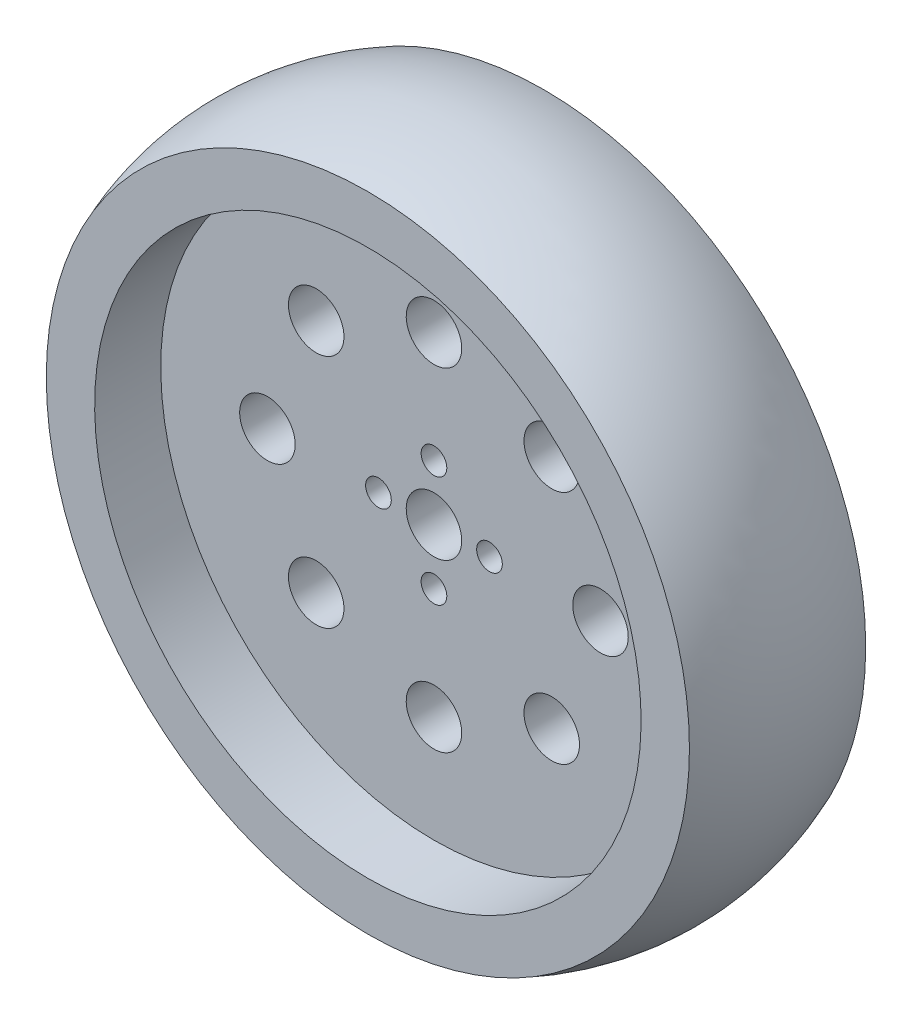
ISO-10303-21;
HEADER;
FILE_DESCRIPTION(('STEP AP214'),'2;1');
FILE_NAME('part.step','',(''),(''),'','','');
FILE_SCHEMA(('AUTOMOTIVE_DESIGN { 1 0 10303 214 1 1 1 1 }'));
ENDSEC;
DATA;
#1=APPLICATION_CONTEXT('core data for automotive mechanical design processes');
#2=APPLICATION_PROTOCOL_DEFINITION('international standard','automotive_design',2000,#1);
#3=PRODUCT_CONTEXT('',#1,'mechanical');
#4=PRODUCT('Part','Part','',(#3));
#5=PRODUCT_RELATED_PRODUCT_CATEGORY('part','',(#4));
#6=PRODUCT_DEFINITION_FORMATION('','',#4);
#7=PRODUCT_DEFINITION_CONTEXT('part definition',#1,'design');
#8=PRODUCT_DEFINITION('design','',#6,#7);
#9=PRODUCT_DEFINITION_SHAPE('','',#8);
#10=(LENGTH_UNIT() NAMED_UNIT(*) SI_UNIT(.MILLI.,.METRE.));
#11=(NAMED_UNIT(*) PLANE_ANGLE_UNIT() SI_UNIT($,.RADIAN.));
#12=(NAMED_UNIT(*) SI_UNIT($,.STERADIAN.) SOLID_ANGLE_UNIT());
#13=UNCERTAINTY_MEASURE_WITH_UNIT(LENGTH_MEASURE(1.E-05),#10,'distance_accuracy_value','');
#14=(GEOMETRIC_REPRESENTATION_CONTEXT(3) GLOBAL_UNCERTAINTY_ASSIGNED_CONTEXT((#13)) GLOBAL_UNIT_ASSIGNED_CONTEXT((#10,
#11,#12)) REPRESENTATION_CONTEXT('',''));
#15=CARTESIAN_POINT('',(0.,0.,0.));
#16=DIRECTION('',(0.,0.,1.));
#17=DIRECTION('',(1.,0.,0.));
#18=AXIS2_PLACEMENT_3D('',#15,#16,#17);
#19=CARTESIAN_POINT('',(0.,0.,-3.17500000000001));
#20=DIRECTION('',(0.,0.,1.));
#21=DIRECTION('',(0.,-1.,0.));
#22=AXIS2_PLACEMENT_3D('',#19,#20,#21);
#23=CYLINDRICAL_SURFACE('',#22,4.);
#24=CARTESIAN_POINT('',(0.,0.,3.175));
#25=DIRECTION('',(0.,0.,1.));
#26=DIRECTION('',(0.,-1.,0.));
#27=AXIS2_PLACEMENT_3D('',#24,#25,#26);
#28=CIRCLE('',#27,4.);
#29=CARTESIAN_POINT('',(0.,-4.,3.175));
#30=VERTEX_POINT('',#29);
#31=EDGE_CURVE('E19',#30,#30,#28,.F.);
#32=ORIENTED_EDGE('',*,*,#31,.F.);
#33=EDGE_LOOP('',(#32));
#34=FACE_BOUND('',#33,.T.);
#35=CARTESIAN_POINT('',(0.,0.,-3.17500000000001));
#36=DIRECTION('',(0.,0.,1.));
#37=DIRECTION('',(0.,-1.,0.));
#38=AXIS2_PLACEMENT_3D('',#35,#36,#37);
#39=CIRCLE('',#38,4.);
#40=CARTESIAN_POINT('',(0.,-4.,-3.17500000000001));
#41=VERTEX_POINT('',#40);
#42=EDGE_CURVE('E78',#41,#41,#39,.F.);
#43=ORIENTED_EDGE('',*,*,#42,.T.);
#44=EDGE_LOOP('',(#43));
#45=FACE_BOUND('',#44,.T.);
#46=ADVANCED_FACE('F15',(#34,#45),#23,.F.);
#47=CARTESIAN_POINT('',(8.,0.,-15.24));
#48=DIRECTION('',(0.,0.,1.));
#49=DIRECTION('',(1.,0.,0.));
#50=AXIS2_PLACEMENT_3D('',#47,#48,#49);
#51=CYLINDRICAL_SURFACE('',#50,1.85);
#52=CARTESIAN_POINT('',(8.,0.,3.175));
#53=DIRECTION('',(0.,0.,1.));
#54=DIRECTION('',(1.,0.,0.));
#55=AXIS2_PLACEMENT_3D('',#52,#53,#54);
#56=CIRCLE('',#55,1.85);
#57=CARTESIAN_POINT('',(9.85,0.,3.175));
#58=VERTEX_POINT('',#57);
#59=EDGE_CURVE('E113',#58,#58,#56,.F.);
#60=ORIENTED_EDGE('',*,*,#59,.F.);
#61=EDGE_LOOP('',(#60));
#62=FACE_BOUND('',#61,.T.);
#63=CARTESIAN_POINT('',(8.,0.,-3.17500000000001));
#64=DIRECTION('',(0.,0.,1.));
#65=DIRECTION('',(1.,0.,0.));
#66=AXIS2_PLACEMENT_3D('',#63,#64,#65);
#67=CIRCLE('',#66,1.85);
#68=CARTESIAN_POINT('',(9.85,0.,-3.17500000000001));
#69=VERTEX_POINT('',#68);
#70=EDGE_CURVE('E75',#69,#69,#67,.F.);
#71=ORIENTED_EDGE('',*,*,#70,.T.);
#72=EDGE_LOOP('',(#71));
#73=FACE_BOUND('',#72,.T.);
#74=ADVANCED_FACE('F125',(#62,#73),#51,.F.);
#75=CARTESIAN_POINT('',(0.,-8.,-15.24));
#76=DIRECTION('',(0.,0.,1.));
#77=DIRECTION('',(1.,0.,0.));
#78=AXIS2_PLACEMENT_3D('',#75,#76,#77);
#79=CYLINDRICAL_SURFACE('',#78,1.85);
#80=CARTESIAN_POINT('',(0.,-8.,3.175));
#81=DIRECTION('',(0.,0.,1.));
#82=DIRECTION('',(1.,0.,0.));
#83=AXIS2_PLACEMENT_3D('',#80,#81,#82);
#84=CIRCLE('',#83,1.85);
#85=CARTESIAN_POINT('',(1.85,-8.,3.175));
#86=VERTEX_POINT('',#85);
#87=EDGE_CURVE('E111',#86,#86,#84,.F.);
#88=ORIENTED_EDGE('',*,*,#87,.F.);
#89=EDGE_LOOP('',(#88));
#90=FACE_BOUND('',#89,.T.);
#91=CARTESIAN_POINT('',(0.,-8.,-3.175));
#92=DIRECTION('',(0.,0.,1.));
#93=DIRECTION('',(1.,0.,0.));
#94=AXIS2_PLACEMENT_3D('',#91,#92,#93);
#95=CIRCLE('',#94,1.85);
#96=CARTESIAN_POINT('',(1.85,-8.,-3.175));
#97=VERTEX_POINT('',#96);
#98=EDGE_CURVE('E72',#97,#97,#95,.F.);
#99=ORIENTED_EDGE('',*,*,#98,.T.);
#100=EDGE_LOOP('',(#99));
#101=FACE_BOUND('',#100,.T.);
#102=ADVANCED_FACE('F298',(#90,#101),#79,.F.);
#103=CARTESIAN_POINT('',(-8.,0.,-15.24));
#104=DIRECTION('',(0.,0.,1.));
#105=DIRECTION('',(1.,0.,0.));
#106=AXIS2_PLACEMENT_3D('',#103,#104,#105);
#107=CYLINDRICAL_SURFACE('',#106,1.85);
#108=CARTESIAN_POINT('',(-8.,0.,3.175));
#109=DIRECTION('',(0.,0.,1.));
#110=DIRECTION('',(1.,0.,0.));
#111=AXIS2_PLACEMENT_3D('',#108,#109,#110);
#112=CIRCLE('',#111,1.85);
#113=CARTESIAN_POINT('',(-6.15,0.,3.175));
#114=VERTEX_POINT('',#113);
#115=EDGE_CURVE('E108',#114,#114,#112,.F.);
#116=ORIENTED_EDGE('',*,*,#115,.F.);
#117=EDGE_LOOP('',(#116));
#118=FACE_BOUND('',#117,.T.);
#119=CARTESIAN_POINT('',(-8.,0.,-3.17500000000001));
#120=DIRECTION('',(0.,0.,1.));
#121=DIRECTION('',(1.,0.,0.));
#122=AXIS2_PLACEMENT_3D('',#119,#120,#121);
#123=CIRCLE('',#122,1.85);
#124=CARTESIAN_POINT('',(-6.15,0.,-3.17500000000001));
#125=VERTEX_POINT('',#124);
#126=EDGE_CURVE('E69',#125,#125,#123,.F.);
#127=ORIENTED_EDGE('',*,*,#126,.T.);
#128=EDGE_LOOP('',(#127));
#129=FACE_BOUND('',#128,.T.);
#130=ADVANCED_FACE('F288',(#118,#129),#107,.F.);
#131=CARTESIAN_POINT('',(0.,8.,-15.24));
#132=DIRECTION('',(0.,0.,1.));
#133=DIRECTION('',(1.,0.,0.));
#134=AXIS2_PLACEMENT_3D('',#131,#132,#133);
#135=CYLINDRICAL_SURFACE('',#134,1.85);
#136=CARTESIAN_POINT('',(0.,8.,3.175));
#137=DIRECTION('',(0.,0.,1.));
#138=DIRECTION('',(1.,0.,0.));
#139=AXIS2_PLACEMENT_3D('',#136,#137,#138);
#140=CIRCLE('',#139,1.85);
#141=CARTESIAN_POINT('',(1.85,8.,3.175));
#142=VERTEX_POINT('',#141);
#143=EDGE_CURVE('E105',#142,#142,#140,.F.);
#144=ORIENTED_EDGE('',*,*,#143,.F.);
#145=EDGE_LOOP('',(#144));
#146=FACE_BOUND('',#145,.T.);
#147=CARTESIAN_POINT('',(0.,8.,-3.17500000000001));
#148=DIRECTION('',(0.,0.,1.));
#149=DIRECTION('',(1.,0.,0.));
#150=AXIS2_PLACEMENT_3D('',#147,#148,#149);
#151=CIRCLE('',#150,1.85);
#152=CARTESIAN_POINT('',(1.85,8.,-3.17500000000001));
#153=VERTEX_POINT('',#152);
#154=EDGE_CURVE('E66',#153,#153,#151,.F.);
#155=ORIENTED_EDGE('',*,*,#154,.T.);
#156=EDGE_LOOP('',(#155));
#157=FACE_BOUND('',#156,.T.);
#158=ADVANCED_FACE('F278',(#146,#157),#135,.F.);
#159=CARTESIAN_POINT('',(0.,-24.,3.17500000000001));
#160=DIRECTION('',(0.,0.,-1.));
#161=DIRECTION('',(0.,1.,0.));
#162=AXIS2_PLACEMENT_3D('',#159,#160,#161);
#163=CYLINDRICAL_SURFACE('',#162,4.);
#164=CARTESIAN_POINT('',(0.,-24.,3.175));
#165=DIRECTION('',(0.,0.,-1.));
#166=DIRECTION('',(0.,1.,0.));
#167=AXIS2_PLACEMENT_3D('',#164,#165,#166);
#168=CIRCLE('',#167,4.);
#169=CARTESIAN_POINT('',(0.,-20.,3.175));
#170=VERTEX_POINT('',#169);
#171=EDGE_CURVE('E102',#170,#170,#168,.T.);
#172=ORIENTED_EDGE('',*,*,#171,.F.);
#173=EDGE_LOOP('',(#172));
#174=FACE_BOUND('',#173,.T.);
#175=CARTESIAN_POINT('',(0.,-24.,-3.175));
#176=DIRECTION('',(0.,0.,-1.));
#177=DIRECTION('',(0.,1.,0.));
#178=AXIS2_PLACEMENT_3D('',#175,#176,#177);
#179=CIRCLE('',#178,4.);
#180=CARTESIAN_POINT('',(0.,-20.,-3.175));
#181=VERTEX_POINT('',#180);
#182=EDGE_CURVE('E63',#181,#181,#179,.T.);
#183=ORIENTED_EDGE('',*,*,#182,.T.);
#184=EDGE_LOOP('',(#183));
#185=FACE_BOUND('',#184,.T.);
#186=ADVANCED_FACE('F268',(#174,#185),#163,.F.);
#187=CARTESIAN_POINT('',(16.9705627484771,-16.9705627484771,3.175));
#188=DIRECTION('',(0.,0.,-1.));
#189=DIRECTION('',(0.,1.,0.));
#190=AXIS2_PLACEMENT_3D('',#187,#188,#189);
#191=CYLINDRICAL_SURFACE('',#190,4.);
#192=CARTESIAN_POINT('',(16.9705627484771,-16.9705627484771,3.175));
#193=DIRECTION('',(0.,0.,-1.));
#194=DIRECTION('',(0.,1.,0.));
#195=AXIS2_PLACEMENT_3D('',#192,#193,#194);
#196=CIRCLE('',#195,4.);
#197=CARTESIAN_POINT('',(16.9705627484771,-12.9705627484771,3.175));
#198=VERTEX_POINT('',#197);
#199=EDGE_CURVE('E99',#198,#198,#196,.T.);
#200=ORIENTED_EDGE('',*,*,#199,.F.);
#201=EDGE_LOOP('',(#200));
#202=FACE_BOUND('',#201,.T.);
#203=CARTESIAN_POINT('',(16.9705627484771,-16.9705627484771,-3.175));
#204=DIRECTION('',(0.,0.,-1.));
#205=DIRECTION('',(0.,1.,0.));
#206=AXIS2_PLACEMENT_3D('',#203,#204,#205);
#207=CIRCLE('',#206,4.);
#208=CARTESIAN_POINT('',(16.9705627484771,-12.9705627484771,-3.175));
#209=VERTEX_POINT('',#208);
#210=EDGE_CURVE('E60',#209,#209,#207,.T.);
#211=ORIENTED_EDGE('',*,*,#210,.T.);
#212=EDGE_LOOP('',(#211));
#213=FACE_BOUND('',#212,.T.);
#214=ADVANCED_FACE('F258',(#202,#213),#191,.F.);
#215=CARTESIAN_POINT('',(24.,0.,3.175));
#216=DIRECTION('',(0.,0.,-1.));
#217=DIRECTION('',(0.,1.,0.));
#218=AXIS2_PLACEMENT_3D('',#215,#216,#217);
#219=CYLINDRICAL_SURFACE('',#218,4.);
#220=CARTESIAN_POINT('',(24.,0.,3.175));
#221=DIRECTION('',(0.,0.,-1.));
#222=DIRECTION('',(0.,1.,0.));
#223=AXIS2_PLACEMENT_3D('',#220,#221,#222);
#224=CIRCLE('',#223,4.);
#225=CARTESIAN_POINT('',(24.,4.,3.175));
#226=VERTEX_POINT('',#225);
#227=EDGE_CURVE('E96',#226,#226,#224,.T.);
#228=ORIENTED_EDGE('',*,*,#227,.F.);
#229=EDGE_LOOP('',(#228));
#230=FACE_BOUND('',#229,.T.);
#231=CARTESIAN_POINT('',(24.,0.,-3.17500000000001));
#232=DIRECTION('',(0.,0.,-1.));
#233=DIRECTION('',(0.,1.,0.));
#234=AXIS2_PLACEMENT_3D('',#231,#232,#233);
#235=CIRCLE('',#234,4.);
#236=CARTESIAN_POINT('',(24.,4.,-3.17500000000001));
#237=VERTEX_POINT('',#236);
#238=EDGE_CURVE('E57',#237,#237,#235,.T.);
#239=ORIENTED_EDGE('',*,*,#238,.T.);
#240=EDGE_LOOP('',(#239));
#241=FACE_BOUND('',#240,.T.);
#242=ADVANCED_FACE('F248',(#230,#241),#219,.F.);
#243=CARTESIAN_POINT('',(16.9705627484771,16.9705627484771,3.175));
#244=DIRECTION('',(0.,0.,-1.));
#245=DIRECTION('',(0.,1.,0.));
#246=AXIS2_PLACEMENT_3D('',#243,#244,#245);
#247=CYLINDRICAL_SURFACE('',#246,4.);
#248=CARTESIAN_POINT('',(16.9705627484771,16.9705627484771,3.175));
#249=DIRECTION('',(0.,0.,-1.));
#250=DIRECTION('',(0.,1.,0.));
#251=AXIS2_PLACEMENT_3D('',#248,#249,#250);
#252=CIRCLE('',#251,4.);
#253=CARTESIAN_POINT('',(16.9705627484771,20.9705627484771,3.175));
#254=VERTEX_POINT('',#253);
#255=EDGE_CURVE('E93',#254,#254,#252,.T.);
#256=ORIENTED_EDGE('',*,*,#255,.F.);
#257=EDGE_LOOP('',(#256));
#258=FACE_BOUND('',#257,.T.);
#259=CARTESIAN_POINT('',(16.9705627484771,16.9705627484771,-3.17500000000001));
#260=DIRECTION('',(0.,0.,-1.));
#261=DIRECTION('',(0.,1.,0.));
#262=AXIS2_PLACEMENT_3D('',#259,#260,#261);
#263=CIRCLE('',#262,4.);
#264=CARTESIAN_POINT('',(16.9705627484771,20.9705627484771,-3.17500000000001));
#265=VERTEX_POINT('',#264);
#266=EDGE_CURVE('E54',#265,#265,#263,.T.);
#267=ORIENTED_EDGE('',*,*,#266,.T.);
#268=EDGE_LOOP('',(#267));
#269=FACE_BOUND('',#268,.T.);
#270=ADVANCED_FACE('F238',(#258,#269),#247,.F.);
#271=CARTESIAN_POINT('',(0.,24.,3.175));
#272=DIRECTION('',(0.,0.,-1.));
#273=DIRECTION('',(0.,1.,0.));
#274=AXIS2_PLACEMENT_3D('',#271,#272,#273);
#275=CYLINDRICAL_SURFACE('',#274,4.);
#276=CARTESIAN_POINT('',(0.,24.,3.175));
#277=DIRECTION('',(0.,0.,-1.));
#278=DIRECTION('',(0.,1.,0.));
#279=AXIS2_PLACEMENT_3D('',#276,#277,#278);
#280=CIRCLE('',#279,4.);
#281=CARTESIAN_POINT('',(0.,28.,3.175));
#282=VERTEX_POINT('',#281);
#283=EDGE_CURVE('E90',#282,#282,#280,.T.);
#284=ORIENTED_EDGE('',*,*,#283,.F.);
#285=EDGE_LOOP('',(#284));
#286=FACE_BOUND('',#285,.T.);
#287=CARTESIAN_POINT('',(0.,24.,-3.17500000000001));
#288=DIRECTION('',(0.,0.,-1.));
#289=DIRECTION('',(0.,1.,0.));
#290=AXIS2_PLACEMENT_3D('',#287,#288,#289);
#291=CIRCLE('',#290,4.);
#292=CARTESIAN_POINT('',(0.,28.,-3.17500000000001));
#293=VERTEX_POINT('',#292);
#294=EDGE_CURVE('E51',#293,#293,#291,.T.);
#295=ORIENTED_EDGE('',*,*,#294,.T.);
#296=EDGE_LOOP('',(#295));
#297=FACE_BOUND('',#296,.T.);
#298=ADVANCED_FACE('F228',(#286,#297),#275,.F.);
#299=CARTESIAN_POINT('',(-16.9705627484771,16.9705627484771,3.175));
#300=DIRECTION('',(0.,0.,-1.));
#301=DIRECTION('',(0.,1.,0.));
#302=AXIS2_PLACEMENT_3D('',#299,#300,#301);
#303=CYLINDRICAL_SURFACE('',#302,4.);
#304=CARTESIAN_POINT('',(-16.9705627484771,16.9705627484771,3.175));
#305=DIRECTION('',(0.,0.,-1.));
#306=DIRECTION('',(0.,1.,0.));
#307=AXIS2_PLACEMENT_3D('',#304,#305,#306);
#308=CIRCLE('',#307,4.);
#309=CARTESIAN_POINT('',(-16.9705627484771,20.9705627484771,3.175));
#310=VERTEX_POINT('',#309);
#311=EDGE_CURVE('E87',#310,#310,#308,.T.);
#312=ORIENTED_EDGE('',*,*,#311,.F.);
#313=EDGE_LOOP('',(#312));
#314=FACE_BOUND('',#313,.T.);
#315=CARTESIAN_POINT('',(-16.9705627484771,16.9705627484771,-3.17500000000001));
#316=DIRECTION('',(0.,0.,-1.));
#317=DIRECTION('',(0.,1.,0.));
#318=AXIS2_PLACEMENT_3D('',#315,#316,#317);
#319=CIRCLE('',#318,4.);
#320=CARTESIAN_POINT('',(-16.9705627484771,20.9705627484771,-3.17500000000001));
#321=VERTEX_POINT('',#320);
#322=EDGE_CURVE('E48',#321,#321,#319,.T.);
#323=ORIENTED_EDGE('',*,*,#322,.T.);
#324=EDGE_LOOP('',(#323));
#325=FACE_BOUND('',#324,.T.);
#326=ADVANCED_FACE('F218',(#314,#325),#303,.F.);
#327=CARTESIAN_POINT('',(-24.,0.,3.175));
#328=DIRECTION('',(0.,0.,-1.));
#329=DIRECTION('',(0.,1.,0.));
#330=AXIS2_PLACEMENT_3D('',#327,#328,#329);
#331=CYLINDRICAL_SURFACE('',#330,4.);
#332=CARTESIAN_POINT('',(-24.,0.,3.175));
#333=DIRECTION('',(0.,0.,-1.));
#334=DIRECTION('',(0.,1.,0.));
#335=AXIS2_PLACEMENT_3D('',#332,#333,#334);
#336=CIRCLE('',#335,4.);
#337=CARTESIAN_POINT('',(-24.,4.00000000000001,3.175));
#338=VERTEX_POINT('',#337);
#339=EDGE_CURVE('E84',#338,#338,#336,.T.);
#340=ORIENTED_EDGE('',*,*,#339,.F.);
#341=EDGE_LOOP('',(#340));
#342=FACE_BOUND('',#341,.T.);
#343=CARTESIAN_POINT('',(-24.,0.,-3.17500000000001));
#344=DIRECTION('',(0.,0.,-1.));
#345=DIRECTION('',(0.,1.,0.));
#346=AXIS2_PLACEMENT_3D('',#343,#344,#345);
#347=CIRCLE('',#346,4.);
#348=CARTESIAN_POINT('',(-24.,4.00000000000001,-3.17500000000001));
#349=VERTEX_POINT('',#348);
#350=EDGE_CURVE('E45',#349,#349,#347,.T.);
#351=ORIENTED_EDGE('',*,*,#350,.T.);
#352=EDGE_LOOP('',(#351));
#353=FACE_BOUND('',#352,.T.);
#354=ADVANCED_FACE('F208',(#342,#353),#331,.F.);
#355=CARTESIAN_POINT('',(-16.9705627484771,-16.9705627484771,3.175));
#356=DIRECTION('',(0.,0.,-1.));
#357=DIRECTION('',(0.,1.,0.));
#358=AXIS2_PLACEMENT_3D('',#355,#356,#357);
#359=CYLINDRICAL_SURFACE('',#358,4.);
#360=CARTESIAN_POINT('',(-16.9705627484771,-16.9705627484771,3.175));
#361=DIRECTION('',(0.,0.,-1.));
#362=DIRECTION('',(0.,1.,0.));
#363=AXIS2_PLACEMENT_3D('',#360,#361,#362);
#364=CIRCLE('',#363,4.);
#365=CARTESIAN_POINT('',(-16.9705627484771,-12.9705627484771,3.175));
#366=VERTEX_POINT('',#365);
#367=EDGE_CURVE('E81',#366,#366,#364,.T.);
#368=ORIENTED_EDGE('',*,*,#367,.F.);
#369=EDGE_LOOP('',(#368));
#370=FACE_BOUND('',#369,.T.);
#371=CARTESIAN_POINT('',(-16.9705627484771,-16.9705627484771,-3.175));
#372=DIRECTION('',(0.,0.,-1.));
#373=DIRECTION('',(0.,1.,0.));
#374=AXIS2_PLACEMENT_3D('',#371,#372,#373);
#375=CIRCLE('',#374,4.);
#376=CARTESIAN_POINT('',(-16.9705627484771,-12.9705627484771,-3.175));
#377=VERTEX_POINT('',#376);
#378=EDGE_CURVE('E42',#377,#377,#375,.T.);
#379=ORIENTED_EDGE('',*,*,#378,.T.);
#380=EDGE_LOOP('',(#379));
#381=FACE_BOUND('',#380,.T.);
#382=ADVANCED_FACE('F198',(#370,#381),#359,.F.);
#383=CARTESIAN_POINT('',(0.,0.,3.175));
#384=DIRECTION('',(0.,0.,1.));
#385=DIRECTION('',(0.,-1.,0.));
#386=AXIS2_PLACEMENT_3D('',#383,#384,#385);
#387=PLANE('',#386);
#388=ORIENTED_EDGE('',*,*,#367,.T.);
#389=EDGE_LOOP('',(#388));
#390=FACE_BOUND('',#389,.T.);
#391=ORIENTED_EDGE('',*,*,#339,.T.);
#392=EDGE_LOOP('',(#391));
#393=FACE_BOUND('',#392,.T.);
#394=ORIENTED_EDGE('',*,*,#311,.T.);
#395=EDGE_LOOP('',(#394));
#396=FACE_BOUND('',#395,.T.);
#397=ORIENTED_EDGE('',*,*,#283,.T.);
#398=EDGE_LOOP('',(#397));
#399=FACE_BOUND('',#398,.T.);
#400=ORIENTED_EDGE('',*,*,#255,.T.);
#401=EDGE_LOOP('',(#400));
#402=FACE_BOUND('',#401,.T.);
#403=ORIENTED_EDGE('',*,*,#227,.T.);
#404=EDGE_LOOP('',(#403));
#405=FACE_BOUND('',#404,.T.);
#406=ORIENTED_EDGE('',*,*,#199,.T.);
#407=EDGE_LOOP('',(#406));
#408=FACE_BOUND('',#407,.T.);
#409=ORIENTED_EDGE('',*,*,#171,.T.);
#410=EDGE_LOOP('',(#409));
#411=FACE_BOUND('',#410,.T.);
#412=ORIENTED_EDGE('',*,*,#143,.T.);
#413=EDGE_LOOP('',(#412));
#414=FACE_BOUND('',#413,.T.);
#415=ORIENTED_EDGE('',*,*,#115,.T.);
#416=EDGE_LOOP('',(#415));
#417=FACE_BOUND('',#416,.T.);
#418=ORIENTED_EDGE('',*,*,#87,.T.);
#419=EDGE_LOOP('',(#418));
#420=FACE_BOUND('',#419,.T.);
#421=ORIENTED_EDGE('',*,*,#59,.T.);
#422=EDGE_LOOP('',(#421));
#423=FACE_BOUND('',#422,.T.);
#424=ORIENTED_EDGE('',*,*,#31,.T.);
#425=EDGE_LOOP('',(#424));
#426=FACE_BOUND('',#425,.T.);
#427=CARTESIAN_POINT('',(0.,0.,3.175));
#428=DIRECTION('',(0.,0.,1.));
#429=DIRECTION('',(0.,-1.,0.));
#430=AXIS2_PLACEMENT_3D('',#427,#428,#429);
#431=CIRCLE('',#430,39.37);
#432=CARTESIAN_POINT('',(0.,-39.37,3.17500000000001));
#433=VERTEX_POINT('',#432);
#434=EDGE_CURVE('E39',#433,#433,#431,.T.);
#435=ORIENTED_EDGE('',*,*,#434,.T.);
#436=EDGE_LOOP('',(#435));
#437=FACE_BOUND('',#436,.T.);
#438=ADVANCED_FACE('F120',(#390,#393,#396,#399,#402,#405,#408,#411,#414,#417,#420,#423,#426,
#437),#387,.T.);
#439=CARTESIAN_POINT('',(0.,0.,-3.17500000000001));
#440=DIRECTION('',(0.,0.,1.));
#441=DIRECTION('',(0.,-1.,0.));
#442=AXIS2_PLACEMENT_3D('',#439,#440,#441);
#443=PLANE('',#442);
#444=ORIENTED_EDGE('',*,*,#378,.F.);
#445=EDGE_LOOP('',(#444));
#446=FACE_BOUND('',#445,.T.);
#447=ORIENTED_EDGE('',*,*,#350,.F.);
#448=EDGE_LOOP('',(#447));
#449=FACE_BOUND('',#448,.T.);
#450=ORIENTED_EDGE('',*,*,#322,.F.);
#451=EDGE_LOOP('',(#450));
#452=FACE_BOUND('',#451,.T.);
#453=ORIENTED_EDGE('',*,*,#294,.F.);
#454=EDGE_LOOP('',(#453));
#455=FACE_BOUND('',#454,.T.);
#456=ORIENTED_EDGE('',*,*,#266,.F.);
#457=EDGE_LOOP('',(#456));
#458=FACE_BOUND('',#457,.T.);
#459=ORIENTED_EDGE('',*,*,#238,.F.);
#460=EDGE_LOOP('',(#459));
#461=FACE_BOUND('',#460,.T.);
#462=ORIENTED_EDGE('',*,*,#210,.F.);
#463=EDGE_LOOP('',(#462));
#464=FACE_BOUND('',#463,.T.);
#465=ORIENTED_EDGE('',*,*,#182,.F.);
#466=EDGE_LOOP('',(#465));
#467=FACE_BOUND('',#466,.T.);
#468=ORIENTED_EDGE('',*,*,#154,.F.);
#469=EDGE_LOOP('',(#468));
#470=FACE_BOUND('',#469,.T.);
#471=ORIENTED_EDGE('',*,*,#126,.F.);
#472=EDGE_LOOP('',(#471));
#473=FACE_BOUND('',#472,.T.);
#474=ORIENTED_EDGE('',*,*,#98,.F.);
#475=EDGE_LOOP('',(#474));
#476=FACE_BOUND('',#475,.T.);
#477=ORIENTED_EDGE('',*,*,#70,.F.);
#478=EDGE_LOOP('',(#477));
#479=FACE_BOUND('',#478,.T.);
#480=ORIENTED_EDGE('',*,*,#42,.F.);
#481=EDGE_LOOP('',(#480));
#482=FACE_BOUND('',#481,.T.);
#483=CARTESIAN_POINT('',(0.,0.,-3.175));
#484=DIRECTION('',(0.,0.,1.));
#485=DIRECTION('',(0.,-1.,0.));
#486=AXIS2_PLACEMENT_3D('',#483,#484,#485);
#487=CIRCLE('',#486,39.37);
#488=CARTESIAN_POINT('',(0.,-39.37,-3.17499999999999));
#489=VERTEX_POINT('',#488);
#490=EDGE_CURVE('E36',#489,#489,#487,.F.);
#491=ORIENTED_EDGE('',*,*,#490,.T.);
#492=EDGE_LOOP('',(#491));
#493=FACE_BOUND('',#492,.T.);
#494=ADVANCED_FACE('F128',(#446,#449,#452,#455,#458,#461,#464,#467,#470,#473,#476,#479,#482,
#493),#443,.F.);
#495=CARTESIAN_POINT('',(0.,0.,-13.97));
#496=DIRECTION('',(0.,0.,1.));
#497=DIRECTION('',(0.,-1.,0.));
#498=AXIS2_PLACEMENT_3D('',#495,#496,#497);
#499=CYLINDRICAL_SURFACE('',#498,39.37);
#500=ORIENTED_EDGE('',*,*,#434,.F.);
#501=EDGE_LOOP('',(#500));
#502=FACE_BOUND('',#501,.T.);
#503=CARTESIAN_POINT('',(0.,0.,12.7));
#504=DIRECTION('',(0.,0.,1.));
#505=DIRECTION('',(0.,-1.,0.));
#506=AXIS2_PLACEMENT_3D('',#503,#504,#505);
#507=CIRCLE('',#506,39.37);
#508=CARTESIAN_POINT('',(0.,-39.37,12.7));
#509=VERTEX_POINT('',#508);
#510=EDGE_CURVE('E33',#509,#509,#507,.F.);
#511=ORIENTED_EDGE('',*,*,#510,.F.);
#512=EDGE_LOOP('',(#511));
#513=FACE_BOUND('',#512,.T.);
#514=ADVANCED_FACE('F131',(#502,#513),#499,.F.);
#515=CARTESIAN_POINT('',(0.,0.,-13.97));
#516=DIRECTION('',(0.,0.,1.));
#517=DIRECTION('',(0.,-1.,0.));
#518=AXIS2_PLACEMENT_3D('',#515,#516,#517);
#519=CYLINDRICAL_SURFACE('',#518,39.37);
#520=CARTESIAN_POINT('',(0.,0.,-12.7));
#521=DIRECTION('',(0.,0.,1.));
#522=DIRECTION('',(0.,-1.,0.));
#523=AXIS2_PLACEMENT_3D('',#520,#521,#522);
#524=CIRCLE('',#523,39.37);
#525=CARTESIAN_POINT('',(0.,-39.37,-12.7));
#526=VERTEX_POINT('',#525);
#527=EDGE_CURVE('E28',#526,#526,#524,.F.);
#528=ORIENTED_EDGE('',*,*,#527,.T.);
#529=EDGE_LOOP('',(#528));
#530=FACE_BOUND('',#529,.T.);
#531=ORIENTED_EDGE('',*,*,#490,.F.);
#532=EDGE_LOOP('',(#531));
#533=FACE_BOUND('',#532,.T.);
#534=ADVANCED_FACE('F136',(#530,#533),#519,.F.);
#535=CARTESIAN_POINT('',(0.,0.,12.7));
#536=DIRECTION('',(0.,0.,1.));
#537=DIRECTION('',(0.,-1.,0.));
#538=AXIS2_PLACEMENT_3D('',#535,#536,#537);
#539=PLANE('',#538);
#540=ORIENTED_EDGE('',*,*,#510,.T.);
#541=EDGE_LOOP('',(#540));
#542=FACE_BOUND('',#541,.T.);
#543=CARTESIAN_POINT('',(0.,0.,12.7));
#544=DIRECTION('',(0.,0.,1.));
#545=DIRECTION('',(1.,0.,0.));
#546=AXIS2_PLACEMENT_3D('',#543,#544,#545);
#547=CIRCLE('',#546,46.339023447152);
#548=CARTESIAN_POINT('',(46.339023447152,0.,12.7));
#549=VERTEX_POINT('',#548);
#550=EDGE_CURVE('E23',#549,#549,#547,.T.);
#551=ORIENTED_EDGE('',*,*,#550,.T.);
#552=EDGE_LOOP('',(#551));
#553=FACE_BOUND('',#552,.T.);
#554=ADVANCED_FACE('F138',(#542,#553),#539,.T.);
#555=CARTESIAN_POINT('',(0.,0.,-12.7));
#556=DIRECTION('',(0.,0.,1.));
#557=DIRECTION('',(0.,-1.,0.));
#558=AXIS2_PLACEMENT_3D('',#555,#556,#557);
#559=PLANE('',#558);
#560=ORIENTED_EDGE('',*,*,#527,.F.);
#561=EDGE_LOOP('',(#560));
#562=FACE_BOUND('',#561,.T.);
#563=CARTESIAN_POINT('',(0.,0.,-12.7));
#564=DIRECTION('',(0.,0.,1.));
#565=DIRECTION('',(1.,0.,0.));
#566=AXIS2_PLACEMENT_3D('',#563,#564,#565);
#567=CIRCLE('',#566,46.339023447152);
#568=CARTESIAN_POINT('',(46.339023447152,0.,-12.7));
#569=VERTEX_POINT('',#568);
#570=EDGE_CURVE('E9',#569,#569,#567,.F.);
#571=ORIENTED_EDGE('',*,*,#570,.T.);
#572=EDGE_LOOP('',(#571));
#573=FACE_BOUND('',#572,.T.);
#574=ADVANCED_FACE('F146',(#562,#573),#559,.F.);
#575=CARTESIAN_POINT('',(0.,0.,0.));
#576=DIRECTION('',(0.,0.,1.));
#577=DIRECTION('',(1.,0.,0.));
#578=AXIS2_PLACEMENT_3D('',#575,#576,#577);
#579=DEGENERATE_TOROIDAL_SURFACE('',#578,14.8000000000001,34.,.T.);
#580=ORIENTED_EDGE('',*,*,#570,.F.);
#581=EDGE_LOOP('',(#580));
#582=FACE_BOUND('',#581,.T.);
#583=ORIENTED_EDGE('',*,*,#550,.F.);
#584=EDGE_LOOP('',(#583));
#585=FACE_BOUND('',#584,.T.);
#586=ADVANCED_FACE('F17',(#582,#585),#579,.T.);
#587=CLOSED_SHELL('',(#46,#74,#102,#130,#158,#186,#214,#242,#270,#298,#326,#354,#382,#438,#494,
#514,#534,#554,#574,#586));
#588=MANIFOLD_SOLID_BREP('B1',#587);
#589=ADVANCED_BREP_SHAPE_REPRESENTATION('',(#18,#588),#14);
#590=SHAPE_DEFINITION_REPRESENTATION(#9,#589);
ENDSEC;
END-ISO-10303-21;
